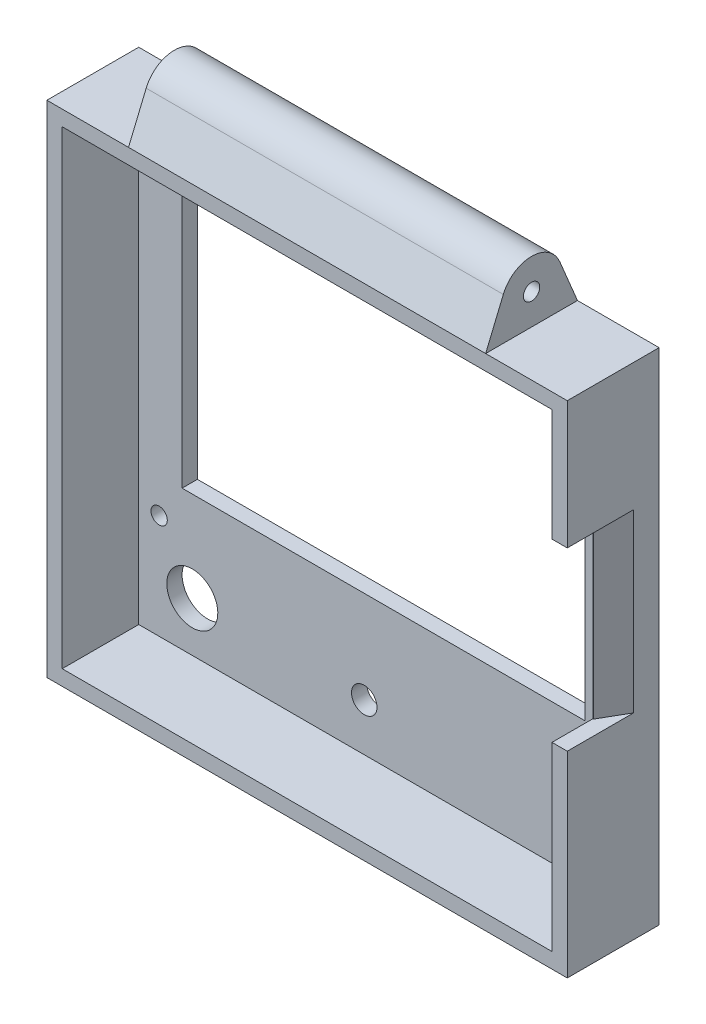
ISO-10303-21;
HEADER;
FILE_DESCRIPTION(('STEP AP214'),'2;1');
FILE_NAME('part.step','',(''),(''),'','','');
FILE_SCHEMA(('AUTOMOTIVE_DESIGN { 1 0 10303 214 1 1 1 1 }'));
ENDSEC;
DATA;
#1=APPLICATION_CONTEXT('core data for automotive mechanical design processes');
#2=APPLICATION_PROTOCOL_DEFINITION('international standard','automotive_design',2000,#1);
#3=PRODUCT_CONTEXT('',#1,'mechanical');
#4=PRODUCT('Part','Part','',(#3));
#5=PRODUCT_RELATED_PRODUCT_CATEGORY('part','',(#4));
#6=PRODUCT_DEFINITION_FORMATION('','',#4);
#7=PRODUCT_DEFINITION_CONTEXT('part definition',#1,'design');
#8=PRODUCT_DEFINITION('design','',#6,#7);
#9=PRODUCT_DEFINITION_SHAPE('','',#8);
#10=(LENGTH_UNIT() NAMED_UNIT(*) SI_UNIT(.MILLI.,.METRE.));
#11=(NAMED_UNIT(*) PLANE_ANGLE_UNIT() SI_UNIT($,.RADIAN.));
#12=(NAMED_UNIT(*) SI_UNIT($,.STERADIAN.) SOLID_ANGLE_UNIT());
#13=UNCERTAINTY_MEASURE_WITH_UNIT(LENGTH_MEASURE(1.E-05),#10,'distance_accuracy_value','');
#14=(GEOMETRIC_REPRESENTATION_CONTEXT(3) GLOBAL_UNCERTAINTY_ASSIGNED_CONTEXT((#13)) GLOBAL_UNIT_ASSIGNED_CONTEXT((#10,
#11,#12)) REPRESENTATION_CONTEXT('',''));
#15=CARTESIAN_POINT('',(0.,0.,0.));
#16=DIRECTION('',(0.,0.,1.));
#17=DIRECTION('',(1.,0.,0.));
#18=AXIS2_PLACEMENT_3D('',#15,#16,#17);
#19=CARTESIAN_POINT('',(51.,98.,0.));
#20=DIRECTION('',(0.,0.,-1.));
#21=DIRECTION('',(0.,1.,0.));
#22=AXIS2_PLACEMENT_3D('',#19,#20,#21);
#23=PLANE('',#22);
#24=DIRECTION('',(0.,-1.,0.));
#25=VECTOR('',#24,1.);
#26=CARTESIAN_POINT('',(48.,98.,0.));
#27=LINE('',#26,#25);
#28=CARTESIAN_POINT('',(48.,95.,0.));
#29=VERTEX_POINT('',#28);
#30=CARTESIAN_POINT('',(48.,73.,0.));
#31=VERTEX_POINT('',#30);
#32=EDGE_CURVE('E376',#29,#31,#27,.T.);
#33=ORIENTED_EDGE('',*,*,#32,.T.);
#34=DIRECTION('',(1.,0.,0.));
#35=VECTOR('',#34,1.);
#36=CARTESIAN_POINT('',(41.,73.,0.));
#37=LINE('',#36,#35);
#38=CARTESIAN_POINT('',(51.,73.,0.));
#39=VERTEX_POINT('',#38);
#40=EDGE_CURVE('E257',#31,#39,#37,.T.);
#41=ORIENTED_EDGE('',*,*,#40,.T.);
#42=DIRECTION('',(0.,-1.,0.));
#43=VECTOR('',#42,1.);
#44=CARTESIAN_POINT('',(51.,98.,0.));
#45=LINE('',#44,#43);
#46=CARTESIAN_POINT('',(51.,98.,0.));
#47=VERTEX_POINT('',#46);
#48=EDGE_CURVE('E193',#47,#39,#45,.T.);
#49=ORIENTED_EDGE('',*,*,#48,.F.);
#50=DIRECTION('',(-1.,0.,0.));
#51=VECTOR('',#50,1.);
#52=CARTESIAN_POINT('',(51.,98.,0.));
#53=LINE('',#52,#51);
#54=CARTESIAN_POINT('',(35.,98.,0.));
#55=VERTEX_POINT('',#54);
#56=EDGE_CURVE('E213',#47,#55,#53,.T.);
#57=ORIENTED_EDGE('',*,*,#56,.T.);
#58=CARTESIAN_POINT('',(-35.,98.,0.));
#59=VERTEX_POINT('',#58);
#60=EDGE_CURVE('E208',#55,#59,#53,.T.);
#61=ORIENTED_EDGE('',*,*,#60,.T.);
#62=DIRECTION('',(-1.,0.,0.));
#63=VECTOR('',#62,1.);
#64=CARTESIAN_POINT('',(-35.,98.,0.));
#65=LINE('',#64,#63);
#66=CARTESIAN_POINT('',(-51.,98.,0.));
#67=VERTEX_POINT('',#66);
#68=EDGE_CURVE('E261',#59,#67,#65,.T.);
#69=ORIENTED_EDGE('',*,*,#68,.T.);
#70=DIRECTION('',(0.,-1.,0.));
#71=VECTOR('',#70,1.);
#72=CARTESIAN_POINT('',(-51.,98.,0.));
#73=LINE('',#72,#71);
#74=CARTESIAN_POINT('',(-51.,0.,0.));
#75=VERTEX_POINT('',#74);
#76=EDGE_CURVE('E209',#67,#75,#73,.T.);
#77=ORIENTED_EDGE('',*,*,#76,.T.);
#78=DIRECTION('',(-1.,0.,0.));
#79=VECTOR('',#78,1.);
#80=CARTESIAN_POINT('',(51.,0.,0.));
#81=LINE('',#80,#79);
#82=CARTESIAN_POINT('',(51.,0.,0.));
#83=VERTEX_POINT('',#82);
#84=EDGE_CURVE('E192',#83,#75,#81,.T.);
#85=ORIENTED_EDGE('',*,*,#84,.F.);
#86=CARTESIAN_POINT('',(51.,38.5,0.));
#87=VERTEX_POINT('',#86);
#88=EDGE_CURVE('E182',#87,#83,#45,.T.);
#89=ORIENTED_EDGE('',*,*,#88,.F.);
#90=DIRECTION('',(1.,0.,0.));
#91=VECTOR('',#90,1.);
#92=CARTESIAN_POINT('',(41.,38.5,0.));
#93=LINE('',#92,#91);
#94=CARTESIAN_POINT('',(48.,38.5,0.));
#95=VERTEX_POINT('',#94);
#96=EDGE_CURVE('E172',#95,#87,#93,.T.);
#97=ORIENTED_EDGE('',*,*,#96,.F.);
#98=CARTESIAN_POINT('',(48.,3.,0.));
#99=VERTEX_POINT('',#98);
#100=EDGE_CURVE('E385',#95,#99,#27,.T.);
#101=ORIENTED_EDGE('',*,*,#100,.T.);
#102=DIRECTION('',(-1.,0.,0.));
#103=VECTOR('',#102,1.);
#104=CARTESIAN_POINT('',(51.,3.,0.));
#105=LINE('',#104,#103);
#106=CARTESIAN_POINT('',(-48.,3.,0.));
#107=VERTEX_POINT('',#106);
#108=EDGE_CURVE('E211',#99,#107,#105,.T.);
#109=ORIENTED_EDGE('',*,*,#108,.T.);
#110=DIRECTION('',(0.,-1.,0.));
#111=VECTOR('',#110,1.);
#112=CARTESIAN_POINT('',(-48.,98.,0.));
#113=LINE('',#112,#111);
#114=CARTESIAN_POINT('',(-48.,95.,0.));
#115=VERTEX_POINT('',#114);
#116=EDGE_CURVE('E202',#115,#107,#113,.T.);
#117=ORIENTED_EDGE('',*,*,#116,.F.);
#118=DIRECTION('',(-1.,0.,0.));
#119=VECTOR('',#118,1.);
#120=CARTESIAN_POINT('',(51.,95.,0.));
#121=LINE('',#120,#119);
#122=EDGE_CURVE('E381',#29,#115,#121,.T.);
#123=ORIENTED_EDGE('',*,*,#122,.F.);
#124=EDGE_LOOP('',(#33,#41,#49,#57,#61,#69,#77,#85,#89,#97,#101,#109,#117,#123));
#125=FACE_BOUND('',#124,.T.);
#126=ADVANCED_FACE('F32',(#125),#23,.F.);
#127=CARTESIAN_POINT('',(51.,0.,0.));
#128=DIRECTION('',(0.,1.,0.));
#129=DIRECTION('',(0.,0.,1.));
#130=AXIS2_PLACEMENT_3D('',#127,#128,#129);
#131=PLANE('',#130);
#132=DIRECTION('',(0.,0.,-1.));
#133=VECTOR('',#132,1.);
#134=CARTESIAN_POINT('',(-51.,0.,0.));
#135=LINE('',#134,#133);
#136=CARTESIAN_POINT('',(-51.,0.,-18.));
#137=VERTEX_POINT('',#136);
#138=EDGE_CURVE('E198',#75,#137,#135,.T.);
#139=ORIENTED_EDGE('',*,*,#138,.T.);
#140=DIRECTION('',(-1.,0.,0.));
#141=VECTOR('',#140,1.);
#142=CARTESIAN_POINT('',(51.,0.,-18.));
#143=LINE('',#142,#141);
#144=CARTESIAN_POINT('',(51.,0.,-18.));
#145=VERTEX_POINT('',#144);
#146=EDGE_CURVE('E220',#145,#137,#143,.T.);
#147=ORIENTED_EDGE('',*,*,#146,.F.);
#148=DIRECTION('',(0.,0.,-1.));
#149=VECTOR('',#148,1.);
#150=CARTESIAN_POINT('',(51.,0.,0.));
#151=LINE('',#150,#149);
#152=EDGE_CURVE('E196',#83,#145,#151,.T.);
#153=ORIENTED_EDGE('',*,*,#152,.F.);
#154=ORIENTED_EDGE('',*,*,#84,.T.);
#155=EDGE_LOOP('',(#139,#147,#153,#154));
#156=FACE_BOUND('',#155,.T.);
#157=ADVANCED_FACE('F442',(#156),#131,.F.);
#158=CARTESIAN_POINT('',(51.,0.,-18.));
#159=DIRECTION('',(0.,0.,1.));
#160=DIRECTION('',(0.,-1.,0.));
#161=AXIS2_PLACEMENT_3D('',#158,#159,#160);
#162=PLANE('',#161);
#163=CARTESIAN_POINT('',(-3.79999999999999,12.3,-18.));
#164=DIRECTION('',(0.,0.,-1.));
#165=DIRECTION('',(-1.,0.,0.));
#166=AXIS2_PLACEMENT_3D('',#163,#164,#165);
#167=CIRCLE('',#166,2.5);
#168=CARTESIAN_POINT('',(-6.29999999999999,12.3,-18.));
#169=VERTEX_POINT('',#168);
#170=EDGE_CURVE('E291',#169,#169,#167,.T.);
#171=ORIENTED_EDGE('',*,*,#170,.F.);
#172=EDGE_LOOP('',(#171));
#173=FACE_BOUND('',#172,.T.);
#174=CARTESIAN_POINT('',(36.75,15.3,-18.));
#175=DIRECTION('',(0.,0.,-1.));
#176=DIRECTION('',(-1.,0.,0.));
#177=AXIS2_PLACEMENT_3D('',#174,#175,#176);
#178=CIRCLE('',#177,3.);
#179=CARTESIAN_POINT('',(33.75,15.3,-18.));
#180=VERTEX_POINT('',#179);
#181=EDGE_CURVE('E307',#180,#180,#178,.T.);
#182=ORIENTED_EDGE('',*,*,#181,.F.);
#183=EDGE_LOOP('',(#182));
#184=FACE_BOUND('',#183,.T.);
#185=CARTESIAN_POINT('',(-37.5,12.7,-18.));
#186=DIRECTION('',(0.,0.,-1.));
#187=DIRECTION('',(-1.,0.,0.));
#188=AXIS2_PLACEMENT_3D('',#185,#186,#187);
#189=CIRCLE('',#188,5.);
#190=CARTESIAN_POINT('',(-42.5,12.7,-18.));
#191=VERTEX_POINT('',#190);
#192=EDGE_CURVE('E301',#191,#191,#189,.T.);
#193=ORIENTED_EDGE('',*,*,#192,.F.);
#194=EDGE_LOOP('',(#193));
#195=FACE_BOUND('',#194,.T.);
#196=CARTESIAN_POINT('',(-44.,23.5,-18.));
#197=DIRECTION('',(0.,0.,-1.));
#198=DIRECTION('',(-1.,0.,0.));
#199=AXIS2_PLACEMENT_3D('',#196,#197,#198);
#200=CIRCLE('',#199,1.6);
#201=CARTESIAN_POINT('',(-45.6,23.5,-18.));
#202=VERTEX_POINT('',#201);
#203=EDGE_CURVE('E293',#202,#202,#200,.T.);
#204=ORIENTED_EDGE('',*,*,#203,.F.);
#205=EDGE_LOOP('',(#204));
#206=FACE_BOUND('',#205,.T.);
#207=CARTESIAN_POINT('',(44.,23.5,-18.));
#208=DIRECTION('',(0.,0.,-1.));
#209=DIRECTION('',(-1.,0.,0.));
#210=AXIS2_PLACEMENT_3D('',#207,#208,#209);
#211=CIRCLE('',#210,1.6);
#212=CARTESIAN_POINT('',(42.4,23.5,-18.));
#213=VERTEX_POINT('',#212);
#214=EDGE_CURVE('E300',#213,#213,#211,.T.);
#215=ORIENTED_EDGE('',*,*,#214,.F.);
#216=EDGE_LOOP('',(#215));
#217=FACE_BOUND('',#216,.T.);
#218=CARTESIAN_POINT('',(44.,88.5,-18.));
#219=DIRECTION('',(0.,0.,-1.));
#220=DIRECTION('',(-1.,0.,0.));
#221=AXIS2_PLACEMENT_3D('',#218,#219,#220);
#222=CIRCLE('',#221,1.6);
#223=CARTESIAN_POINT('',(42.4,88.5,-18.));
#224=VERTEX_POINT('',#223);
#225=EDGE_CURVE('E325',#224,#224,#222,.T.);
#226=ORIENTED_EDGE('',*,*,#225,.F.);
#227=EDGE_LOOP('',(#226));
#228=FACE_BOUND('',#227,.T.);
#229=CARTESIAN_POINT('',(-44.,88.5,-18.));
#230=DIRECTION('',(0.,0.,-1.));
#231=DIRECTION('',(-1.,0.,0.));
#232=AXIS2_PLACEMENT_3D('',#229,#230,#231);
#233=CIRCLE('',#232,1.6);
#234=CARTESIAN_POINT('',(-45.6,88.5,-18.));
#235=VERTEX_POINT('',#234);
#236=EDGE_CURVE('E317',#235,#235,#233,.T.);
#237=ORIENTED_EDGE('',*,*,#236,.F.);
#238=EDGE_LOOP('',(#237));
#239=FACE_BOUND('',#238,.T.);
#240=DIRECTION('',(0.,-1.,0.));
#241=VECTOR('',#240,1.);
#242=CARTESIAN_POINT('',(39.5,82.,-18.));
#243=LINE('',#242,#241);
#244=CARTESIAN_POINT('',(39.5,82.,-18.));
#245=VERTEX_POINT('',#244);
#246=CARTESIAN_POINT('',(39.5,30.4,-18.));
#247=VERTEX_POINT('',#246);
#248=EDGE_CURVE('E338',#245,#247,#243,.T.);
#249=ORIENTED_EDGE('',*,*,#248,.F.);
#250=DIRECTION('',(1.,0.,0.));
#251=VECTOR('',#250,1.);
#252=CARTESIAN_POINT('',(39.5,82.,-18.));
#253=LINE('',#252,#251);
#254=CARTESIAN_POINT('',(-39.5,82.,-18.));
#255=VERTEX_POINT('',#254);
#256=EDGE_CURVE('E341',#255,#245,#253,.T.);
#257=ORIENTED_EDGE('',*,*,#256,.F.);
#258=DIRECTION('',(0.,1.,0.));
#259=VECTOR('',#258,1.);
#260=CARTESIAN_POINT('',(-39.5,82.,-18.));
#261=LINE('',#260,#259);
#262=CARTESIAN_POINT('',(-39.5,30.4,-18.));
#263=VERTEX_POINT('',#262);
#264=EDGE_CURVE('E324',#263,#255,#261,.T.);
#265=ORIENTED_EDGE('',*,*,#264,.F.);
#266=DIRECTION('',(-1.,0.,0.));
#267=VECTOR('',#266,1.);
#268=CARTESIAN_POINT('',(39.5,30.4,-18.));
#269=LINE('',#268,#267);
#270=EDGE_CURVE('E335',#247,#263,#269,.T.);
#271=ORIENTED_EDGE('',*,*,#270,.F.);
#272=EDGE_LOOP('',(#249,#257,#265,#271));
#273=FACE_BOUND('',#272,.T.);
#274=DIRECTION('',(0.,1.,0.));
#275=VECTOR('',#274,1.);
#276=CARTESIAN_POINT('',(-51.,0.,-18.));
#277=LINE('',#276,#275);
#278=CARTESIAN_POINT('',(-51.,98.,-18.));
#279=VERTEX_POINT('',#278);
#280=EDGE_CURVE('E194',#137,#279,#277,.T.);
#281=ORIENTED_EDGE('',*,*,#280,.T.);
#282=DIRECTION('',(-1.,0.,0.));
#283=VECTOR('',#282,1.);
#284=CARTESIAN_POINT('',(-35.,98.,-18.));
#285=LINE('',#284,#283);
#286=CARTESIAN_POINT('',(-35.,98.,-18.));
#287=VERTEX_POINT('',#286);
#288=EDGE_CURVE('E265',#287,#279,#285,.T.);
#289=ORIENTED_EDGE('',*,*,#288,.F.);
#290=DIRECTION('',(-1.,0.,0.));
#291=VECTOR('',#290,1.);
#292=CARTESIAN_POINT('',(51.,98.,-18.));
#293=LINE('',#292,#291);
#294=CARTESIAN_POINT('',(35.,98.,-18.));
#295=VERTEX_POINT('',#294);
#296=EDGE_CURVE('E216',#295,#287,#293,.T.);
#297=ORIENTED_EDGE('',*,*,#296,.F.);
#298=CARTESIAN_POINT('',(51.,98.,-18.));
#299=VERTEX_POINT('',#298);
#300=EDGE_CURVE('E217',#299,#295,#293,.T.);
#301=ORIENTED_EDGE('',*,*,#300,.F.);
#302=DIRECTION('',(0.,1.,0.));
#303=VECTOR('',#302,1.);
#304=CARTESIAN_POINT('',(51.,0.,-18.));
#305=LINE('',#304,#303);
#306=EDGE_CURVE('E205',#145,#299,#305,.T.);
#307=ORIENTED_EDGE('',*,*,#306,.F.);
#308=ORIENTED_EDGE('',*,*,#146,.T.);
#309=EDGE_LOOP('',(#281,#289,#297,#301,#307,#308));
#310=FACE_BOUND('',#309,.T.);
#311=ADVANCED_FACE('F437',(#173,#184,#195,#206,#217,#228,#239,#273,#310),#162,.F.);
#312=CARTESIAN_POINT('',(51.,0.,0.));
#313=DIRECTION('',(1.,0.,0.));
#314=DIRECTION('',(0.,0.,-1.));
#315=AXIS2_PLACEMENT_3D('',#312,#313,#314);
#316=PLANE('',#315);
#317=DIRECTION('',(0.,0.,1.));
#318=VECTOR('',#317,1.);
#319=CARTESIAN_POINT('',(51.,73.,0.));
#320=LINE('',#319,#318);
#321=CARTESIAN_POINT('',(51.,73.,-13.));
#322=VERTEX_POINT('',#321);
#323=EDGE_CURVE('E47',#322,#39,#320,.T.);
#324=ORIENTED_EDGE('',*,*,#323,.F.);
#325=DIRECTION('',(0.,-1.,0.));
#326=VECTOR('',#325,1.);
#327=CARTESIAN_POINT('',(51.,38.5,-13.));
#328=LINE('',#327,#326);
#329=CARTESIAN_POINT('',(51.,38.5,-13.));
#330=VERTEX_POINT('',#329);
#331=EDGE_CURVE('E185',#322,#330,#328,.T.);
#332=ORIENTED_EDGE('',*,*,#331,.T.);
#333=DIRECTION('',(0.,0.,-1.));
#334=VECTOR('',#333,1.);
#335=CARTESIAN_POINT('',(51.,38.5,0.));
#336=LINE('',#335,#334);
#337=EDGE_CURVE('E54',#87,#330,#336,.T.);
#338=ORIENTED_EDGE('',*,*,#337,.F.);
#339=ORIENTED_EDGE('',*,*,#88,.T.);
#340=ORIENTED_EDGE('',*,*,#152,.T.);
#341=ORIENTED_EDGE('',*,*,#306,.T.);
#342=DIRECTION('',(0.,0.,-1.));
#343=VECTOR('',#342,1.);
#344=CARTESIAN_POINT('',(51.,98.,0.));
#345=LINE('',#344,#343);
#346=EDGE_CURVE('E228',#47,#299,#345,.T.);
#347=ORIENTED_EDGE('',*,*,#346,.F.);
#348=ORIENTED_EDGE('',*,*,#48,.T.);
#349=EDGE_LOOP('',(#324,#332,#338,#339,#340,#341,#347,#348));
#350=FACE_BOUND('',#349,.T.);
#351=ADVANCED_FACE('F181',(#350),#316,.T.);
#352=CARTESIAN_POINT('',(-51.,0.,0.));
#353=DIRECTION('',(1.,0.,0.));
#354=DIRECTION('',(0.,0.,-1.));
#355=AXIS2_PLACEMENT_3D('',#352,#353,#354);
#356=PLANE('',#355);
#357=ORIENTED_EDGE('',*,*,#76,.F.);
#358=DIRECTION('',(0.,0.,-1.));
#359=VECTOR('',#358,1.);
#360=CARTESIAN_POINT('',(-51.,98.,0.));
#361=LINE('',#360,#359);
#362=EDGE_CURVE('E233',#67,#279,#361,.T.);
#363=ORIENTED_EDGE('',*,*,#362,.T.);
#364=ORIENTED_EDGE('',*,*,#280,.F.);
#365=ORIENTED_EDGE('',*,*,#138,.F.);
#366=EDGE_LOOP('',(#357,#363,#364,#365));
#367=FACE_BOUND('',#366,.T.);
#368=ADVANCED_FACE('F435',(#367),#356,.F.);
#369=CARTESIAN_POINT('',(51.,3.,0.));
#370=DIRECTION('',(0.,1.,0.));
#371=DIRECTION('',(0.,0.,1.));
#372=AXIS2_PLACEMENT_3D('',#369,#370,#371);
#373=PLANE('',#372);
#374=DIRECTION('',(0.,0.,-1.));
#375=VECTOR('',#374,1.);
#376=CARTESIAN_POINT('',(-48.,3.,0.));
#377=LINE('',#376,#375);
#378=CARTESIAN_POINT('',(-48.,3.00000000000001,-15.));
#379=VERTEX_POINT('',#378);
#380=EDGE_CURVE('E366',#107,#379,#377,.T.);
#381=ORIENTED_EDGE('',*,*,#380,.F.);
#382=ORIENTED_EDGE('',*,*,#108,.F.);
#383=DIRECTION('',(0.,0.,-1.));
#384=VECTOR('',#383,1.);
#385=CARTESIAN_POINT('',(48.,3.,0.));
#386=LINE('',#385,#384);
#387=CARTESIAN_POINT('',(48.,3.00000000000001,-15.));
#388=VERTEX_POINT('',#387);
#389=EDGE_CURVE('E373',#99,#388,#386,.T.);
#390=ORIENTED_EDGE('',*,*,#389,.T.);
#391=DIRECTION('',(-1.,0.,0.));
#392=VECTOR('',#391,1.);
#393=CARTESIAN_POINT('',(51.,3.00000000000001,-15.));
#394=LINE('',#393,#392);
#395=EDGE_CURVE('E369',#388,#379,#394,.T.);
#396=ORIENTED_EDGE('',*,*,#395,.T.);
#397=EDGE_LOOP('',(#381,#382,#390,#396));
#398=FACE_BOUND('',#397,.T.);
#399=ADVANCED_FACE('F454',(#398),#373,.T.);
#400=CARTESIAN_POINT('',(51.,0.,-15.));
#401=DIRECTION('',(0.,0.,1.));
#402=DIRECTION('',(0.,-1.,0.));
#403=AXIS2_PLACEMENT_3D('',#400,#401,#402);
#404=PLANE('',#403);
#405=CARTESIAN_POINT('',(-3.79999999999999,12.3,-15.));
#406=DIRECTION('',(0.,0.,1.));
#407=DIRECTION('',(0.,-1.,0.));
#408=AXIS2_PLACEMENT_3D('',#405,#406,#407);
#409=CIRCLE('',#408,2.5);
#410=CARTESIAN_POINT('',(-3.79999999999999,9.80000000000001,-15.));
#411=VERTEX_POINT('',#410);
#412=EDGE_CURVE('E310',#411,#411,#409,.F.);
#413=ORIENTED_EDGE('',*,*,#412,.T.);
#414=EDGE_LOOP('',(#413));
#415=FACE_BOUND('',#414,.T.);
#416=CARTESIAN_POINT('',(36.75,15.3,-15.));
#417=DIRECTION('',(0.,0.,1.));
#418=DIRECTION('',(0.,-1.,0.));
#419=AXIS2_PLACEMENT_3D('',#416,#417,#418);
#420=CIRCLE('',#419,3.);
#421=CARTESIAN_POINT('',(36.75,12.3,-15.));
#422=VERTEX_POINT('',#421);
#423=EDGE_CURVE('E304',#422,#422,#420,.F.);
#424=ORIENTED_EDGE('',*,*,#423,.T.);
#425=EDGE_LOOP('',(#424));
#426=FACE_BOUND('',#425,.T.);
#427=CARTESIAN_POINT('',(-37.5,12.7,-15.));
#428=DIRECTION('',(0.,0.,1.));
#429=DIRECTION('',(0.,-1.,0.));
#430=AXIS2_PLACEMENT_3D('',#427,#428,#429);
#431=CIRCLE('',#430,5.);
#432=CARTESIAN_POINT('',(-37.5,7.70000000000003,-15.));
#433=VERTEX_POINT('',#432);
#434=EDGE_CURVE('E297',#433,#433,#431,.F.);
#435=ORIENTED_EDGE('',*,*,#434,.T.);
#436=EDGE_LOOP('',(#435));
#437=FACE_BOUND('',#436,.T.);
#438=CARTESIAN_POINT('',(-44.,23.5,-15.));
#439=DIRECTION('',(0.,0.,1.));
#440=DIRECTION('',(0.,-1.,0.));
#441=AXIS2_PLACEMENT_3D('',#438,#439,#440);
#442=CIRCLE('',#441,1.6);
#443=CARTESIAN_POINT('',(-44.,21.9,-15.));
#444=VERTEX_POINT('',#443);
#445=EDGE_CURVE('E296',#444,#444,#442,.F.);
#446=ORIENTED_EDGE('',*,*,#445,.T.);
#447=EDGE_LOOP('',(#446));
#448=FACE_BOUND('',#447,.T.);
#449=CARTESIAN_POINT('',(44.,23.5,-15.));
#450=DIRECTION('',(0.,0.,1.));
#451=DIRECTION('',(0.,-1.,0.));
#452=AXIS2_PLACEMENT_3D('',#449,#450,#451);
#453=CIRCLE('',#452,1.6);
#454=CARTESIAN_POINT('',(44.,21.9,-15.));
#455=VERTEX_POINT('',#454);
#456=EDGE_CURVE('E328',#455,#455,#453,.F.);
#457=ORIENTED_EDGE('',*,*,#456,.T.);
#458=EDGE_LOOP('',(#457));
#459=FACE_BOUND('',#458,.T.);
#460=CARTESIAN_POINT('',(44.,88.5,-15.));
#461=DIRECTION('',(0.,0.,1.));
#462=DIRECTION('',(0.,-1.,0.));
#463=AXIS2_PLACEMENT_3D('',#460,#461,#462);
#464=CIRCLE('',#463,1.6);
#465=CARTESIAN_POINT('',(44.,86.9,-15.));
#466=VERTEX_POINT('',#465);
#467=EDGE_CURVE('E321',#466,#466,#464,.F.);
#468=ORIENTED_EDGE('',*,*,#467,.T.);
#469=EDGE_LOOP('',(#468));
#470=FACE_BOUND('',#469,.T.);
#471=CARTESIAN_POINT('',(-44.,88.5,-15.));
#472=DIRECTION('',(0.,0.,1.));
#473=DIRECTION('',(0.,-1.,0.));
#474=AXIS2_PLACEMENT_3D('',#471,#472,#473);
#475=CIRCLE('',#474,1.6);
#476=CARTESIAN_POINT('',(-44.,86.9,-15.));
#477=VERTEX_POINT('',#476);
#478=EDGE_CURVE('E320',#477,#477,#475,.F.);
#479=ORIENTED_EDGE('',*,*,#478,.T.);
#480=EDGE_LOOP('',(#479));
#481=FACE_BOUND('',#480,.T.);
#482=DIRECTION('',(1.,0.,0.));
#483=VECTOR('',#482,1.);
#484=CARTESIAN_POINT('',(39.5,82.,-15.));
#485=LINE('',#484,#483);
#486=CARTESIAN_POINT('',(-39.5,82.,-15.));
#487=VERTEX_POINT('',#486);
#488=CARTESIAN_POINT('',(39.5,82.,-15.));
#489=VERTEX_POINT('',#488);
#490=EDGE_CURVE('E337',#487,#489,#485,.T.);
#491=ORIENTED_EDGE('',*,*,#490,.T.);
#492=DIRECTION('',(0.,-1.,0.));
#493=VECTOR('',#492,1.);
#494=CARTESIAN_POINT('',(39.5,82.,-15.));
#495=LINE('',#494,#493);
#496=CARTESIAN_POINT('',(39.5,30.4,-15.));
#497=VERTEX_POINT('',#496);
#498=EDGE_CURVE('E358',#489,#497,#495,.T.);
#499=ORIENTED_EDGE('',*,*,#498,.T.);
#500=DIRECTION('',(-1.,0.,0.));
#501=VECTOR('',#500,1.);
#502=CARTESIAN_POINT('',(39.5,30.4,-15.));
#503=LINE('',#502,#501);
#504=CARTESIAN_POINT('',(-39.5,30.4,-15.));
#505=VERTEX_POINT('',#504);
#506=EDGE_CURVE('E354',#497,#505,#503,.T.);
#507=ORIENTED_EDGE('',*,*,#506,.T.);
#508=DIRECTION('',(0.,1.,0.));
#509=VECTOR('',#508,1.);
#510=CARTESIAN_POINT('',(-39.5,82.,-15.));
#511=LINE('',#510,#509);
#512=EDGE_CURVE('E349',#505,#487,#511,.T.);
#513=ORIENTED_EDGE('',*,*,#512,.T.);
#514=EDGE_LOOP('',(#491,#499,#507,#513));
#515=FACE_BOUND('',#514,.T.);
#516=DIRECTION('',(0.,1.,0.));
#517=VECTOR('',#516,1.);
#518=CARTESIAN_POINT('',(-48.,0.,-15.));
#519=LINE('',#518,#517);
#520=CARTESIAN_POINT('',(-48.,95.,-15.));
#521=VERTEX_POINT('',#520);
#522=EDGE_CURVE('E368',#379,#521,#519,.T.);
#523=ORIENTED_EDGE('',*,*,#522,.F.);
#524=ORIENTED_EDGE('',*,*,#395,.F.);
#525=DIRECTION('',(0.,1.,0.));
#526=VECTOR('',#525,1.);
#527=CARTESIAN_POINT('',(48.,0.,-15.));
#528=LINE('',#527,#526);
#529=CARTESIAN_POINT('',(48.,95.,-15.));
#530=VERTEX_POINT('',#529);
#531=EDGE_CURVE('E375',#388,#530,#528,.T.);
#532=ORIENTED_EDGE('',*,*,#531,.T.);
#533=DIRECTION('',(-1.,0.,0.));
#534=VECTOR('',#533,1.);
#535=CARTESIAN_POINT('',(51.,95.,-15.));
#536=LINE('',#535,#534);
#537=EDGE_CURVE('E372',#530,#521,#536,.T.);
#538=ORIENTED_EDGE('',*,*,#537,.T.);
#539=EDGE_LOOP('',(#523,#524,#532,#538));
#540=FACE_BOUND('',#539,.T.);
#541=ADVANCED_FACE('F405',(#415,#426,#437,#448,#459,#470,#481,#515,#540),#404,.T.);
#542=CARTESIAN_POINT('',(51.,95.,-18.));
#543=DIRECTION('',(0.,-1.,0.));
#544=DIRECTION('',(0.,0.,-1.));
#545=AXIS2_PLACEMENT_3D('',#542,#543,#544);
#546=PLANE('',#545);
#547=DIRECTION('',(0.,0.,1.));
#548=VECTOR('',#547,1.);
#549=CARTESIAN_POINT('',(-48.,95.,-18.));
#550=LINE('',#549,#548);
#551=EDGE_CURVE('E378',#521,#115,#550,.T.);
#552=ORIENTED_EDGE('',*,*,#551,.F.);
#553=ORIENTED_EDGE('',*,*,#537,.F.);
#554=DIRECTION('',(0.,0.,1.));
#555=VECTOR('',#554,1.);
#556=CARTESIAN_POINT('',(48.,95.,-18.));
#557=LINE('',#556,#555);
#558=EDGE_CURVE('E383',#530,#29,#557,.T.);
#559=ORIENTED_EDGE('',*,*,#558,.T.);
#560=ORIENTED_EDGE('',*,*,#122,.T.);
#561=EDGE_LOOP('',(#552,#553,#559,#560));
#562=FACE_BOUND('',#561,.T.);
#563=ADVANCED_FACE('F395',(#562),#546,.T.);
#564=CARTESIAN_POINT('',(48.,0.,0.));
#565=DIRECTION('',(1.,0.,0.));
#566=DIRECTION('',(0.,0.,-1.));
#567=AXIS2_PLACEMENT_3D('',#564,#565,#566);
#568=PLANE('',#567);
#569=DIRECTION('',(0.,1.,0.));
#570=VECTOR('',#569,1.);
#571=CARTESIAN_POINT('',(48.,0.,-8.00000000000001));
#572=LINE('',#571,#570);
#573=CARTESIAN_POINT('',(48.,38.5,-8.));
#574=VERTEX_POINT('',#573);
#575=CARTESIAN_POINT('',(48.,73.,-8.));
#576=VERTEX_POINT('',#575);
#577=EDGE_CURVE('E235',#574,#576,#572,.T.);
#578=ORIENTED_EDGE('',*,*,#577,.T.);
#579=DIRECTION('',(0.,0.,1.));
#580=VECTOR('',#579,1.);
#581=CARTESIAN_POINT('',(48.,73.,0.));
#582=LINE('',#581,#580);
#583=EDGE_CURVE('E238',#576,#31,#582,.T.);
#584=ORIENTED_EDGE('',*,*,#583,.T.);
#585=ORIENTED_EDGE('',*,*,#32,.F.);
#586=ORIENTED_EDGE('',*,*,#558,.F.);
#587=ORIENTED_EDGE('',*,*,#531,.F.);
#588=ORIENTED_EDGE('',*,*,#389,.F.);
#589=ORIENTED_EDGE('',*,*,#100,.F.);
#590=DIRECTION('',(0.,0.,-1.));
#591=VECTOR('',#590,1.);
#592=CARTESIAN_POINT('',(48.,38.5,0.));
#593=LINE('',#592,#591);
#594=EDGE_CURVE('E175',#95,#574,#593,.T.);
#595=ORIENTED_EDGE('',*,*,#594,.T.);
#596=EDGE_LOOP('',(#578,#584,#585,#586,#587,#588,#589,#595));
#597=FACE_BOUND('',#596,.T.);
#598=ADVANCED_FACE('F408',(#597),#568,.F.);
#599=CARTESIAN_POINT('',(-48.,0.,0.));
#600=DIRECTION('',(1.,0.,0.));
#601=DIRECTION('',(0.,0.,-1.));
#602=AXIS2_PLACEMENT_3D('',#599,#600,#601);
#603=PLANE('',#602);
#604=ORIENTED_EDGE('',*,*,#116,.T.);
#605=ORIENTED_EDGE('',*,*,#380,.T.);
#606=ORIENTED_EDGE('',*,*,#522,.T.);
#607=ORIENTED_EDGE('',*,*,#551,.T.);
#608=EDGE_LOOP('',(#604,#605,#606,#607));
#609=FACE_BOUND('',#608,.T.);
#610=ADVANCED_FACE('F401',(#609),#603,.T.);
#611=CARTESIAN_POINT('',(39.5,82.,79.3586773964112));
#612=DIRECTION('',(0.,1.,0.));
#613=DIRECTION('',(-1.,0.,0.));
#614=AXIS2_PLACEMENT_3D('',#611,#612,#613);
#615=PLANE('',#614);
#616=DIRECTION('',(0.,0.,-1.));
#617=VECTOR('',#616,1.);
#618=CARTESIAN_POINT('',(-39.5,82.,79.3586773964112));
#619=LINE('',#618,#617);
#620=EDGE_CURVE('E352',#487,#255,#619,.T.);
#621=ORIENTED_EDGE('',*,*,#620,.T.);
#622=ORIENTED_EDGE('',*,*,#256,.T.);
#623=DIRECTION('',(0.,0.,-1.));
#624=VECTOR('',#623,1.);
#625=CARTESIAN_POINT('',(39.5,82.,79.3586773964112));
#626=LINE('',#625,#624);
#627=EDGE_CURVE('E348',#489,#245,#626,.T.);
#628=ORIENTED_EDGE('',*,*,#627,.F.);
#629=ORIENTED_EDGE('',*,*,#490,.F.);
#630=EDGE_LOOP('',(#621,#622,#628,#629));
#631=FACE_BOUND('',#630,.T.);
#632=ADVANCED_FACE('F459',(#631),#615,.F.);
#633=CARTESIAN_POINT('',(39.5,82.,79.3586773964112));
#634=DIRECTION('',(1.,0.,0.));
#635=DIRECTION('',(0.,0.,-1.));
#636=AXIS2_PLACEMENT_3D('',#633,#634,#635);
#637=PLANE('',#636);
#638=ORIENTED_EDGE('',*,*,#627,.T.);
#639=ORIENTED_EDGE('',*,*,#248,.T.);
#640=DIRECTION('',(0.,0.,-1.));
#641=VECTOR('',#640,1.);
#642=CARTESIAN_POINT('',(39.5,30.4,79.3586773964112));
#643=LINE('',#642,#641);
#644=EDGE_CURVE('E357',#497,#247,#643,.T.);
#645=ORIENTED_EDGE('',*,*,#644,.F.);
#646=ORIENTED_EDGE('',*,*,#498,.F.);
#647=EDGE_LOOP('',(#638,#639,#645,#646));
#648=FACE_BOUND('',#647,.T.);
#649=ADVANCED_FACE('F472',(#648),#637,.F.);
#650=CARTESIAN_POINT('',(39.5,30.4,79.3586773964112));
#651=DIRECTION('',(0.,-1.,0.));
#652=DIRECTION('',(1.,0.,0.));
#653=AXIS2_PLACEMENT_3D('',#650,#651,#652);
#654=PLANE('',#653);
#655=ORIENTED_EDGE('',*,*,#644,.T.);
#656=ORIENTED_EDGE('',*,*,#270,.T.);
#657=DIRECTION('',(0.,0.,-1.));
#658=VECTOR('',#657,1.);
#659=CARTESIAN_POINT('',(-39.5,30.4,79.3586773964112));
#660=LINE('',#659,#658);
#661=EDGE_CURVE('E353',#505,#263,#660,.T.);
#662=ORIENTED_EDGE('',*,*,#661,.F.);
#663=ORIENTED_EDGE('',*,*,#506,.F.);
#664=EDGE_LOOP('',(#655,#656,#662,#663));
#665=FACE_BOUND('',#664,.T.);
#666=ADVANCED_FACE('F476',(#665),#654,.F.);
#667=CARTESIAN_POINT('',(-39.5,82.,79.3586773964112));
#668=DIRECTION('',(-1.,0.,0.));
#669=DIRECTION('',(0.,-1.,0.));
#670=AXIS2_PLACEMENT_3D('',#667,#668,#669);
#671=PLANE('',#670);
#672=ORIENTED_EDGE('',*,*,#661,.T.);
#673=ORIENTED_EDGE('',*,*,#264,.T.);
#674=ORIENTED_EDGE('',*,*,#620,.F.);
#675=ORIENTED_EDGE('',*,*,#512,.F.);
#676=EDGE_LOOP('',(#672,#673,#674,#675));
#677=FACE_BOUND('',#676,.T.);
#678=ADVANCED_FACE('F480',(#677),#671,.F.);
#679=CARTESIAN_POINT('',(-44.,88.5,79.3586773964112));
#680=DIRECTION('',(0.,0.,-1.));
#681=DIRECTION('',(-1.,0.,0.));
#682=AXIS2_PLACEMENT_3D('',#679,#680,#681);
#683=CYLINDRICAL_SURFACE('',#682,1.6);
#684=ORIENTED_EDGE('',*,*,#236,.T.);
#685=EDGE_LOOP('',(#684));
#686=FACE_BOUND('',#685,.T.);
#687=ORIENTED_EDGE('',*,*,#478,.F.);
#688=EDGE_LOOP('',(#687));
#689=FACE_BOUND('',#688,.T.);
#690=ADVANCED_FACE('F484',(#686,#689),#683,.F.);
#691=CARTESIAN_POINT('',(44.,88.5,79.3586773964112));
#692=DIRECTION('',(0.,0.,-1.));
#693=DIRECTION('',(-1.,0.,0.));
#694=AXIS2_PLACEMENT_3D('',#691,#692,#693);
#695=CYLINDRICAL_SURFACE('',#694,1.6);
#696=ORIENTED_EDGE('',*,*,#225,.T.);
#697=EDGE_LOOP('',(#696));
#698=FACE_BOUND('',#697,.T.);
#699=ORIENTED_EDGE('',*,*,#467,.F.);
#700=EDGE_LOOP('',(#699));
#701=FACE_BOUND('',#700,.T.);
#702=ADVANCED_FACE('F490',(#698,#701),#695,.F.);
#703=CARTESIAN_POINT('',(44.,23.5,79.3586773964112));
#704=DIRECTION('',(0.,0.,-1.));
#705=DIRECTION('',(-1.,0.,0.));
#706=AXIS2_PLACEMENT_3D('',#703,#704,#705);
#707=CYLINDRICAL_SURFACE('',#706,1.6);
#708=ORIENTED_EDGE('',*,*,#214,.T.);
#709=EDGE_LOOP('',(#708));
#710=FACE_BOUND('',#709,.T.);
#711=ORIENTED_EDGE('',*,*,#456,.F.);
#712=EDGE_LOOP('',(#711));
#713=FACE_BOUND('',#712,.T.);
#714=ADVANCED_FACE('F486',(#710,#713),#707,.F.);
#715=CARTESIAN_POINT('',(-44.,23.5,79.3586773964112));
#716=DIRECTION('',(0.,0.,-1.));
#717=DIRECTION('',(-1.,0.,0.));
#718=AXIS2_PLACEMENT_3D('',#715,#716,#717);
#719=CYLINDRICAL_SURFACE('',#718,1.6);
#720=ORIENTED_EDGE('',*,*,#203,.T.);
#721=EDGE_LOOP('',(#720));
#722=FACE_BOUND('',#721,.T.);
#723=ORIENTED_EDGE('',*,*,#445,.F.);
#724=EDGE_LOOP('',(#723));
#725=FACE_BOUND('',#724,.T.);
#726=ADVANCED_FACE('F489',(#722,#725),#719,.F.);
#727=CARTESIAN_POINT('',(-37.5,12.7,79.3586773964112));
#728=DIRECTION('',(0.,0.,-1.));
#729=DIRECTION('',(-1.,0.,0.));
#730=AXIS2_PLACEMENT_3D('',#727,#728,#729);
#731=CYLINDRICAL_SURFACE('',#730,5.);
#732=ORIENTED_EDGE('',*,*,#192,.T.);
#733=EDGE_LOOP('',(#732));
#734=FACE_BOUND('',#733,.T.);
#735=ORIENTED_EDGE('',*,*,#434,.F.);
#736=EDGE_LOOP('',(#735));
#737=FACE_BOUND('',#736,.T.);
#738=ADVANCED_FACE('F506',(#734,#737),#731,.F.);
#739=CARTESIAN_POINT('',(36.75,15.3,79.3586773964112));
#740=DIRECTION('',(0.,0.,-1.));
#741=DIRECTION('',(-1.,0.,0.));
#742=AXIS2_PLACEMENT_3D('',#739,#740,#741);
#743=CYLINDRICAL_SURFACE('',#742,3.);
#744=ORIENTED_EDGE('',*,*,#181,.T.);
#745=EDGE_LOOP('',(#744));
#746=FACE_BOUND('',#745,.T.);
#747=ORIENTED_EDGE('',*,*,#423,.F.);
#748=EDGE_LOOP('',(#747));
#749=FACE_BOUND('',#748,.T.);
#750=ADVANCED_FACE('F502',(#746,#749),#743,.F.);
#751=CARTESIAN_POINT('',(-3.79999999999999,12.3,79.3586773964112));
#752=DIRECTION('',(0.,0.,-1.));
#753=DIRECTION('',(-1.,0.,0.));
#754=AXIS2_PLACEMENT_3D('',#751,#752,#753);
#755=CYLINDRICAL_SURFACE('',#754,2.5);
#756=ORIENTED_EDGE('',*,*,#170,.T.);
#757=EDGE_LOOP('',(#756));
#758=FACE_BOUND('',#757,.T.);
#759=ORIENTED_EDGE('',*,*,#412,.F.);
#760=EDGE_LOOP('',(#759));
#761=FACE_BOUND('',#760,.T.);
#762=ADVANCED_FACE('F498',(#758,#761),#755,.F.);
#763=CARTESIAN_POINT('',(-51.,104.,-9.00000000000001));
#764=DIRECTION('',(1.,0.,0.));
#765=DIRECTION('',(0.,0.,-1.));
#766=AXIS2_PLACEMENT_3D('',#763,#764,#765);
#767=CYLINDRICAL_SURFACE('',#766,5.99999999999999);
#768=CARTESIAN_POINT('',(-35.,104.,-9.00000000000001));
#769=DIRECTION('',(1.,0.,0.));
#770=DIRECTION('',(0.,1.,0.));
#771=AXIS2_PLACEMENT_3D('',#768,#769,#770);
#772=CIRCLE('',#771,5.99999999999999);
#773=CARTESIAN_POINT('',(-35.,106.307692307692,-3.46153846153848));
#774=VERTEX_POINT('',#773);
#775=CARTESIAN_POINT('',(-35.,106.307692307692,-14.5384615384615));
#776=VERTEX_POINT('',#775);
#777=EDGE_CURVE('E273',#774,#776,#772,.F.);
#778=ORIENTED_EDGE('',*,*,#777,.F.);
#779=DIRECTION('',(1.,0.,0.));
#780=VECTOR('',#779,1.);
#781=CARTESIAN_POINT('',(-51.,106.307692307692,-3.46153846153848));
#782=LINE('',#781,#780);
#783=CARTESIAN_POINT('',(35.,106.307692307692,-3.46153846153848));
#784=VERTEX_POINT('',#783);
#785=EDGE_CURVE('E288',#774,#784,#782,.T.);
#786=ORIENTED_EDGE('',*,*,#785,.T.);
#787=CARTESIAN_POINT('',(35.,104.,-9.00000000000001));
#788=DIRECTION('',(-1.,0.,0.));
#789=DIRECTION('',(0.,-1.,0.));
#790=AXIS2_PLACEMENT_3D('',#787,#788,#789);
#791=CIRCLE('',#790,5.99999999999999);
#792=CARTESIAN_POINT('',(35.,106.307692307692,-14.5384615384615));
#793=VERTEX_POINT('',#792);
#794=EDGE_CURVE('E282',#793,#784,#791,.F.);
#795=ORIENTED_EDGE('',*,*,#794,.F.);
#796=DIRECTION('',(1.,0.,0.));
#797=VECTOR('',#796,1.);
#798=CARTESIAN_POINT('',(-51.,106.307692307692,-14.5384615384615));
#799=LINE('',#798,#797);
#800=EDGE_CURVE('E289',#776,#793,#799,.T.);
#801=ORIENTED_EDGE('',*,*,#800,.F.);
#802=EDGE_LOOP('',(#778,#786,#795,#801));
#803=FACE_BOUND('',#802,.T.);
#804=ADVANCED_FACE('F501',(#803),#767,.T.);
#805=CARTESIAN_POINT('',(-51.,106.307692307692,-14.5384615384615));
#806=DIRECTION('',(0.,0.384615384615385,-0.923076923076923));
#807=DIRECTION('',(0.,0.923076923076923,0.384615384615385));
#808=AXIS2_PLACEMENT_3D('',#805,#806,#807);
#809=PLANE('',#808);
#810=DIRECTION('',(0.,-0.923076923076923,-0.384615384615385));
#811=VECTOR('',#810,1.);
#812=CARTESIAN_POINT('',(-35.,106.307692307692,-14.5384615384616));
#813=LINE('',#812,#811);
#814=EDGE_CURVE('E275',#776,#287,#813,.T.);
#815=ORIENTED_EDGE('',*,*,#814,.F.);
#816=ORIENTED_EDGE('',*,*,#800,.T.);
#817=DIRECTION('',(0.,0.923076923076923,0.384615384615385));
#818=VECTOR('',#817,1.);
#819=CARTESIAN_POINT('',(35.,106.307692307692,-14.5384615384615));
#820=LINE('',#819,#818);
#821=EDGE_CURVE('E285',#295,#793,#820,.T.);
#822=ORIENTED_EDGE('',*,*,#821,.F.);
#823=ORIENTED_EDGE('',*,*,#296,.T.);
#824=EDGE_LOOP('',(#815,#816,#822,#823));
#825=FACE_BOUND('',#824,.T.);
#826=ADVANCED_FACE('F516',(#825),#809,.T.);
#827=CARTESIAN_POINT('',(-51.,98.,0.));
#828=DIRECTION('',(0.,0.384615384615385,0.923076923076923));
#829=DIRECTION('',(0.,-0.923076923076923,0.384615384615385));
#830=AXIS2_PLACEMENT_3D('',#827,#828,#829);
#831=PLANE('',#830);
#832=DIRECTION('',(0.,0.923076923076923,-0.384615384615385));
#833=VECTOR('',#832,1.);
#834=CARTESIAN_POINT('',(-35.,98.,0.));
#835=LINE('',#834,#833);
#836=EDGE_CURVE('E232',#59,#774,#835,.T.);
#837=ORIENTED_EDGE('',*,*,#836,.F.);
#838=ORIENTED_EDGE('',*,*,#60,.F.);
#839=DIRECTION('',(0.,-0.923076923076923,0.384615384615385));
#840=VECTOR('',#839,1.);
#841=CARTESIAN_POINT('',(35.,98.,0.));
#842=LINE('',#841,#840);
#843=EDGE_CURVE('E227',#784,#55,#842,.T.);
#844=ORIENTED_EDGE('',*,*,#843,.F.);
#845=ORIENTED_EDGE('',*,*,#785,.F.);
#846=EDGE_LOOP('',(#837,#838,#844,#845));
#847=FACE_BOUND('',#846,.T.);
#848=ADVANCED_FACE('F424',(#847),#831,.T.);
#849=CARTESIAN_POINT('',(-51.,104.,-9.00000000000001));
#850=DIRECTION('',(1.,0.,0.));
#851=DIRECTION('',(0.,0.,-1.));
#852=AXIS2_PLACEMENT_3D('',#849,#850,#851);
#853=CYLINDRICAL_SURFACE('',#852,1.6);
#854=CARTESIAN_POINT('',(-35.,104.,-9.00000000000001));
#855=DIRECTION('',(1.,0.,0.));
#856=DIRECTION('',(0.,1.,0.));
#857=AXIS2_PLACEMENT_3D('',#854,#855,#856);
#858=CIRCLE('',#857,1.6);
#859=CARTESIAN_POINT('',(-35.,105.6,-9.00000000000001));
#860=VERTEX_POINT('',#859);
#861=EDGE_CURVE('E229',#860,#860,#858,.F.);
#862=ORIENTED_EDGE('',*,*,#861,.T.);
#863=EDGE_LOOP('',(#862));
#864=FACE_BOUND('',#863,.T.);
#865=CARTESIAN_POINT('',(35.,104.,-9.00000000000001));
#866=DIRECTION('',(-1.,0.,0.));
#867=DIRECTION('',(0.,-1.,0.));
#868=AXIS2_PLACEMENT_3D('',#865,#866,#867);
#869=CIRCLE('',#868,1.6);
#870=CARTESIAN_POINT('',(35.,102.4,-9.00000000000001));
#871=VERTEX_POINT('',#870);
#872=EDGE_CURVE('E224',#871,#871,#869,.F.);
#873=ORIENTED_EDGE('',*,*,#872,.T.);
#874=EDGE_LOOP('',(#873));
#875=FACE_BOUND('',#874,.T.);
#876=ADVANCED_FACE('F520',(#864,#875),#853,.F.);
#877=CARTESIAN_POINT('',(35.,98.,0.));
#878=DIRECTION('',(-1.,0.,0.));
#879=DIRECTION('',(0.,-1.,0.));
#880=AXIS2_PLACEMENT_3D('',#877,#878,#879);
#881=PLANE('',#880);
#882=ORIENTED_EDGE('',*,*,#821,.T.);
#883=ORIENTED_EDGE('',*,*,#794,.T.);
#884=ORIENTED_EDGE('',*,*,#843,.T.);
#885=DIRECTION('',(0.,0.,-1.));
#886=VECTOR('',#885,1.);
#887=CARTESIAN_POINT('',(35.,98.,0.));
#888=LINE('',#887,#886);
#889=EDGE_CURVE('E277',#55,#295,#888,.T.);
#890=ORIENTED_EDGE('',*,*,#889,.T.);
#891=EDGE_LOOP('',(#882,#883,#884,#890));
#892=FACE_BOUND('',#891,.T.);
#893=ORIENTED_EDGE('',*,*,#872,.F.);
#894=EDGE_LOOP('',(#893));
#895=FACE_BOUND('',#894,.T.);
#896=ADVANCED_FACE('F526',(#892,#895),#881,.F.);
#897=CARTESIAN_POINT('',(51.,98.,0.));
#898=DIRECTION('',(0.,-1.,0.));
#899=DIRECTION('',(0.,0.,-1.));
#900=AXIS2_PLACEMENT_3D('',#897,#898,#899);
#901=PLANE('',#900);
#902=ORIENTED_EDGE('',*,*,#300,.T.);
#903=ORIENTED_EDGE('',*,*,#889,.F.);
#904=ORIENTED_EDGE('',*,*,#56,.F.);
#905=ORIENTED_EDGE('',*,*,#346,.T.);
#906=EDGE_LOOP('',(#902,#903,#904,#905));
#907=FACE_BOUND('',#906,.T.);
#908=ADVANCED_FACE('F415',(#907),#901,.F.);
#909=CARTESIAN_POINT('',(-35.,98.,0.));
#910=DIRECTION('',(1.,0.,0.));
#911=DIRECTION('',(0.,1.,0.));
#912=AXIS2_PLACEMENT_3D('',#909,#910,#911);
#913=PLANE('',#912);
#914=ORIENTED_EDGE('',*,*,#814,.T.);
#915=DIRECTION('',(0.,0.,-1.));
#916=VECTOR('',#915,1.);
#917=CARTESIAN_POINT('',(-35.,98.,0.));
#918=LINE('',#917,#916);
#919=EDGE_CURVE('E264',#59,#287,#918,.T.);
#920=ORIENTED_EDGE('',*,*,#919,.F.);
#921=ORIENTED_EDGE('',*,*,#836,.T.);
#922=ORIENTED_EDGE('',*,*,#777,.T.);
#923=EDGE_LOOP('',(#914,#920,#921,#922));
#924=FACE_BOUND('',#923,.T.);
#925=ORIENTED_EDGE('',*,*,#861,.F.);
#926=EDGE_LOOP('',(#925));
#927=FACE_BOUND('',#926,.T.);
#928=ADVANCED_FACE('F427',(#924,#927),#913,.F.);
#929=CARTESIAN_POINT('',(-35.,98.,0.));
#930=DIRECTION('',(0.,-1.,0.));
#931=DIRECTION('',(1.,0.,0.));
#932=AXIS2_PLACEMENT_3D('',#929,#930,#931);
#933=PLANE('',#932);
#934=ORIENTED_EDGE('',*,*,#288,.T.);
#935=ORIENTED_EDGE('',*,*,#362,.F.);
#936=ORIENTED_EDGE('',*,*,#68,.F.);
#937=ORIENTED_EDGE('',*,*,#919,.T.);
#938=EDGE_LOOP('',(#934,#935,#936,#937));
#939=FACE_BOUND('',#938,.T.);
#940=ADVANCED_FACE('F432',(#939),#933,.F.);
#941=CARTESIAN_POINT('',(41.,73.,0.));
#942=DIRECTION('',(0.,1.,0.));
#943=DIRECTION('',(0.,0.,1.));
#944=AXIS2_PLACEMENT_3D('',#941,#942,#943);
#945=PLANE('',#944);
#946=DIRECTION('',(1.,0.,0.));
#947=VECTOR('',#946,1.);
#948=CARTESIAN_POINT('',(41.,73.,-8.));
#949=LINE('',#948,#947);
#950=CARTESIAN_POINT('',(48.1132486540519,73.,-8.));
#951=VERTEX_POINT('',#950);
#952=EDGE_CURVE('E249',#576,#951,#949,.T.);
#953=ORIENTED_EDGE('',*,*,#952,.T.);
#954=DIRECTION('',(0.499999999999997,0.,-0.86602540378444));
#955=VECTOR('',#954,1.);
#956=CARTESIAN_POINT('',(42.8708348754012,73.,1.08012701892221));
#957=LINE('',#956,#955);
#958=EDGE_CURVE('E40',#951,#322,#957,.T.);
#959=ORIENTED_EDGE('',*,*,#958,.T.);
#960=ORIENTED_EDGE('',*,*,#323,.T.);
#961=ORIENTED_EDGE('',*,*,#40,.F.);
#962=ORIENTED_EDGE('',*,*,#583,.F.);
#963=EDGE_LOOP('',(#953,#959,#960,#961,#962));
#964=FACE_BOUND('',#963,.T.);
#965=ADVANCED_FACE('F246',(#964),#945,.F.);
#966=CARTESIAN_POINT('',(41.,73.,-8.));
#967=DIRECTION('',(0.,0.,-1.));
#968=DIRECTION('',(0.,1.,0.));
#969=AXIS2_PLACEMENT_3D('',#966,#967,#968);
#970=PLANE('',#969);
#971=DIRECTION('',(1.,0.,0.));
#972=VECTOR('',#971,1.);
#973=CARTESIAN_POINT('',(41.,38.5,-8.));
#974=LINE('',#973,#972);
#975=CARTESIAN_POINT('',(48.1132486540519,38.5,-8.));
#976=VERTEX_POINT('',#975);
#977=EDGE_CURVE('E179',#574,#976,#974,.T.);
#978=ORIENTED_EDGE('',*,*,#977,.T.);
#979=DIRECTION('',(0.,1.,0.));
#980=VECTOR('',#979,1.);
#981=CARTESIAN_POINT('',(48.1132486540519,73.,-8.));
#982=LINE('',#981,#980);
#983=EDGE_CURVE('E241',#976,#951,#982,.T.);
#984=ORIENTED_EDGE('',*,*,#983,.T.);
#985=ORIENTED_EDGE('',*,*,#952,.F.);
#986=ORIENTED_EDGE('',*,*,#577,.F.);
#987=EDGE_LOOP('',(#978,#984,#985,#986));
#988=FACE_BOUND('',#987,.T.);
#989=ADVANCED_FACE('F255',(#988),#970,.F.);
#990=CARTESIAN_POINT('',(41.,38.5,0.));
#991=DIRECTION('',(0.,-1.,0.));
#992=DIRECTION('',(0.,0.,-1.));
#993=AXIS2_PLACEMENT_3D('',#990,#991,#992);
#994=PLANE('',#993);
#995=ORIENTED_EDGE('',*,*,#96,.T.);
#996=ORIENTED_EDGE('',*,*,#337,.T.);
#997=DIRECTION('',(-0.499999999999997,0.,0.86602540378444));
#998=VECTOR('',#997,1.);
#999=CARTESIAN_POINT('',(42.8708348754012,38.5,1.0801270189222));
#1000=LINE('',#999,#998);
#1001=EDGE_CURVE('E11',#330,#976,#1000,.T.);
#1002=ORIENTED_EDGE('',*,*,#1001,.T.);
#1003=ORIENTED_EDGE('',*,*,#977,.F.);
#1004=ORIENTED_EDGE('',*,*,#594,.F.);
#1005=EDGE_LOOP('',(#995,#996,#1002,#1003,#1004));
#1006=FACE_BOUND('',#1005,.T.);
#1007=ADVANCED_FACE('F173',(#1006),#994,.F.);
#1008=CARTESIAN_POINT('',(48.1132486540519,73.,-8.));
#1009=DIRECTION('',(0.86602540378444,0.,0.499999999999997));
#1010=DIRECTION('',(0.,-1.,0.));
#1011=AXIS2_PLACEMENT_3D('',#1008,#1009,#1010);
#1012=PLANE('',#1011);
#1013=ORIENTED_EDGE('',*,*,#1001,.F.);
#1014=ORIENTED_EDGE('',*,*,#331,.F.);
#1015=ORIENTED_EDGE('',*,*,#958,.F.);
#1016=ORIENTED_EDGE('',*,*,#983,.F.);
#1017=EDGE_LOOP('',(#1013,#1014,#1015,#1016));
#1018=FACE_BOUND('',#1017,.T.);
#1019=ADVANCED_FACE('F34',(#1018),#1012,.T.);
#1020=CLOSED_SHELL('',(#126,#157,#311,#351,#368,#399,#541,#563,#598,#610,#632,#649,#666,#678,
#690,#702,#714,#726,#738,#750,#762,#804,#826,#848,#876,#896,#908,#928,#940,#965,#989,#1007,#1019));
#1021=MANIFOLD_SOLID_BREP('B2',#1020);
#1022=ADVANCED_BREP_SHAPE_REPRESENTATION('',(#18,#1021),#14);
#1023=SHAPE_DEFINITION_REPRESENTATION(#9,#1022);
ENDSEC;
END-ISO-10303-21;
